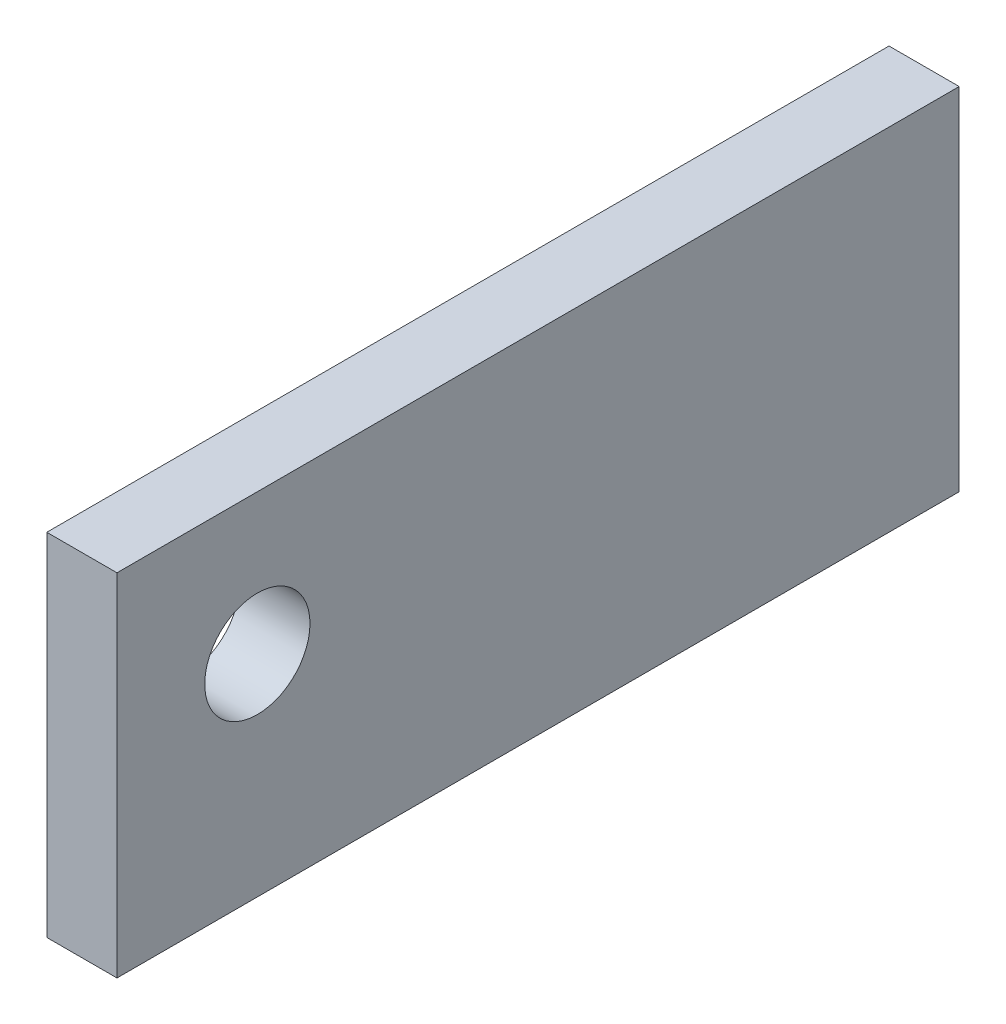
ISO-10303-21;
HEADER;
FILE_DESCRIPTION(('STEP AP214'),'2;1');
FILE_NAME('part.step','',(''),(''),'','','');
FILE_SCHEMA(('AUTOMOTIVE_DESIGN { 1 0 10303 214 1 1 1 1 }'));
ENDSEC;
DATA;
#1=APPLICATION_CONTEXT('core data for automotive mechanical design processes');
#2=APPLICATION_PROTOCOL_DEFINITION('international standard','automotive_design',2000,#1);
#3=PRODUCT_CONTEXT('',#1,'mechanical');
#4=PRODUCT('Part','Part','',(#3));
#5=PRODUCT_RELATED_PRODUCT_CATEGORY('part','',(#4));
#6=PRODUCT_DEFINITION_FORMATION('','',#4);
#7=PRODUCT_DEFINITION_CONTEXT('part definition',#1,'design');
#8=PRODUCT_DEFINITION('design','',#6,#7);
#9=PRODUCT_DEFINITION_SHAPE('','',#8);
#10=(LENGTH_UNIT() NAMED_UNIT(*) SI_UNIT(.MILLI.,.METRE.));
#11=(NAMED_UNIT(*) PLANE_ANGLE_UNIT() SI_UNIT($,.RADIAN.));
#12=(NAMED_UNIT(*) SI_UNIT($,.STERADIAN.) SOLID_ANGLE_UNIT());
#13=UNCERTAINTY_MEASURE_WITH_UNIT(LENGTH_MEASURE(1.E-05),#10,'distance_accuracy_value','');
#14=(GEOMETRIC_REPRESENTATION_CONTEXT(3) GLOBAL_UNCERTAINTY_ASSIGNED_CONTEXT((#13)) GLOBAL_UNIT_ASSIGNED_CONTEXT((#10,
#11,#12)) REPRESENTATION_CONTEXT('',''));
#15=CARTESIAN_POINT('',(0.,0.,0.));
#16=DIRECTION('',(0.,0.,1.));
#17=DIRECTION('',(1.,0.,0.));
#18=AXIS2_PLACEMENT_3D('',#15,#16,#17);
#19=CARTESIAN_POINT('',(6.35,31.75,-76.2));
#20=DIRECTION('',(0.,0.,1.));
#21=DIRECTION('',(1.,0.,0.));
#22=AXIS2_PLACEMENT_3D('',#19,#20,#21);
#23=PLANE('',#22);
#24=DIRECTION('',(0.,1.,0.));
#25=VECTOR('',#24,1.);
#26=CARTESIAN_POINT('',(-6.35,31.75,-76.2));
#27=LINE('',#26,#25);
#28=CARTESIAN_POINT('',(-6.35,-31.75,-76.2));
#29=VERTEX_POINT('',#28);
#30=CARTESIAN_POINT('',(-6.35,31.75,-76.2));
#31=VERTEX_POINT('',#30);
#32=EDGE_CURVE('E96',#29,#31,#27,.T.);
#33=ORIENTED_EDGE('',*,*,#32,.T.);
#34=DIRECTION('',(-1.,0.,0.));
#35=VECTOR('',#34,1.);
#36=CARTESIAN_POINT('',(6.35,31.75,-76.2));
#37=LINE('',#36,#35);
#38=CARTESIAN_POINT('',(6.35,31.75,-76.2));
#39=VERTEX_POINT('',#38);
#40=EDGE_CURVE('E11',#39,#31,#37,.T.);
#41=ORIENTED_EDGE('',*,*,#40,.F.);
#42=DIRECTION('',(0.,1.,0.));
#43=VECTOR('',#42,1.);
#44=CARTESIAN_POINT('',(6.35,31.75,-76.2));
#45=LINE('',#44,#43);
#46=CARTESIAN_POINT('',(6.35,-31.75,-76.2));
#47=VERTEX_POINT('',#46);
#48=EDGE_CURVE('E84',#47,#39,#45,.T.);
#49=ORIENTED_EDGE('',*,*,#48,.F.);
#50=DIRECTION('',(-1.,0.,0.));
#51=VECTOR('',#50,1.);
#52=CARTESIAN_POINT('',(6.35,-31.75,-76.2));
#53=LINE('',#52,#51);
#54=EDGE_CURVE('E92',#47,#29,#53,.T.);
#55=ORIENTED_EDGE('',*,*,#54,.T.);
#56=EDGE_LOOP('',(#33,#41,#49,#55));
#57=FACE_BOUND('',#56,.T.);
#58=ADVANCED_FACE('F33',(#57),#23,.F.);
#59=CARTESIAN_POINT('',(6.35,31.75,76.2));
#60=DIRECTION('',(0.,-1.,0.));
#61=DIRECTION('',(0.,0.,-1.));
#62=AXIS2_PLACEMENT_3D('',#59,#60,#61);
#63=PLANE('',#62);
#64=DIRECTION('',(0.,0.,1.));
#65=VECTOR('',#64,1.);
#66=CARTESIAN_POINT('',(-6.35,31.75,76.2));
#67=LINE('',#66,#65);
#68=CARTESIAN_POINT('',(-6.35,31.75,76.2));
#69=VERTEX_POINT('',#68);
#70=EDGE_CURVE('E88',#31,#69,#67,.T.);
#71=ORIENTED_EDGE('',*,*,#70,.T.);
#72=DIRECTION('',(-1.,0.,0.));
#73=VECTOR('',#72,1.);
#74=CARTESIAN_POINT('',(6.35,31.75,76.2));
#75=LINE('',#74,#73);
#76=CARTESIAN_POINT('',(6.35,31.75,76.2));
#77=VERTEX_POINT('',#76);
#78=EDGE_CURVE('E41',#77,#69,#75,.T.);
#79=ORIENTED_EDGE('',*,*,#78,.F.);
#80=DIRECTION('',(0.,0.,1.));
#81=VECTOR('',#80,1.);
#82=CARTESIAN_POINT('',(6.35,31.75,76.2));
#83=LINE('',#82,#81);
#84=EDGE_CURVE('E79',#39,#77,#83,.T.);
#85=ORIENTED_EDGE('',*,*,#84,.F.);
#86=ORIENTED_EDGE('',*,*,#40,.T.);
#87=EDGE_LOOP('',(#71,#79,#85,#86));
#88=FACE_BOUND('',#87,.T.);
#89=ADVANCED_FACE('F87',(#88),#63,.F.);
#90=CARTESIAN_POINT('',(6.35,31.75,76.2));
#91=DIRECTION('',(0.,0.,-1.));
#92=DIRECTION('',(0.,1.,0.));
#93=AXIS2_PLACEMENT_3D('',#90,#91,#92);
#94=PLANE('',#93);
#95=DIRECTION('',(0.,-1.,0.));
#96=VECTOR('',#95,1.);
#97=CARTESIAN_POINT('',(-6.35,31.75,76.2));
#98=LINE('',#97,#96);
#99=CARTESIAN_POINT('',(-6.35,-31.75,76.2));
#100=VERTEX_POINT('',#99);
#101=EDGE_CURVE('E66',#69,#100,#98,.T.);
#102=ORIENTED_EDGE('',*,*,#101,.T.);
#103=DIRECTION('',(-1.,0.,0.));
#104=VECTOR('',#103,1.);
#105=CARTESIAN_POINT('',(6.35,-31.75,76.2));
#106=LINE('',#105,#104);
#107=CARTESIAN_POINT('',(6.35,-31.75,76.2));
#108=VERTEX_POINT('',#107);
#109=EDGE_CURVE('E89',#108,#100,#106,.T.);
#110=ORIENTED_EDGE('',*,*,#109,.F.);
#111=DIRECTION('',(0.,-1.,0.));
#112=VECTOR('',#111,1.);
#113=CARTESIAN_POINT('',(6.35,31.75,76.2));
#114=LINE('',#113,#112);
#115=EDGE_CURVE('E82',#77,#108,#114,.T.);
#116=ORIENTED_EDGE('',*,*,#115,.F.);
#117=ORIENTED_EDGE('',*,*,#78,.T.);
#118=EDGE_LOOP('',(#102,#110,#116,#117));
#119=FACE_BOUND('',#118,.T.);
#120=ADVANCED_FACE('F90',(#119),#94,.F.);
#121=CARTESIAN_POINT('',(6.35,-31.75,76.2));
#122=DIRECTION('',(0.,1.,0.));
#123=DIRECTION('',(0.,0.,1.));
#124=AXIS2_PLACEMENT_3D('',#121,#122,#123);
#125=PLANE('',#124);
#126=DIRECTION('',(0.,0.,-1.));
#127=VECTOR('',#126,1.);
#128=CARTESIAN_POINT('',(-6.35,-31.75,76.2));
#129=LINE('',#128,#127);
#130=EDGE_CURVE('E72',#100,#29,#129,.T.);
#131=ORIENTED_EDGE('',*,*,#130,.T.);
#132=ORIENTED_EDGE('',*,*,#54,.F.);
#133=DIRECTION('',(0.,0.,-1.));
#134=VECTOR('',#133,1.);
#135=CARTESIAN_POINT('',(6.35,-31.75,76.2));
#136=LINE('',#135,#134);
#137=EDGE_CURVE('E49',#108,#47,#136,.T.);
#138=ORIENTED_EDGE('',*,*,#137,.F.);
#139=ORIENTED_EDGE('',*,*,#109,.T.);
#140=EDGE_LOOP('',(#131,#132,#138,#139));
#141=FACE_BOUND('',#140,.T.);
#142=ADVANCED_FACE('F104',(#141),#125,.F.);
#143=CARTESIAN_POINT('',(6.35,0.,0.));
#144=DIRECTION('',(1.,0.,0.));
#145=DIRECTION('',(0.,0.,-1.));
#146=AXIS2_PLACEMENT_3D('',#143,#144,#145);
#147=PLANE('',#146);
#148=CARTESIAN_POINT('',(6.35,6.35000000000001,50.8));
#149=DIRECTION('',(1.,0.,0.));
#150=DIRECTION('',(0.,0.,-1.));
#151=AXIS2_PLACEMENT_3D('',#148,#149,#150);
#152=CIRCLE('',#151,9.52500000000001);
#153=CARTESIAN_POINT('',(6.35,6.35000000000001,41.275));
#154=VERTEX_POINT('',#153);
#155=EDGE_CURVE('E112',#154,#154,#152,.T.);
#156=ORIENTED_EDGE('',*,*,#155,.F.);
#157=EDGE_LOOP('',(#156));
#158=FACE_BOUND('',#157,.T.);
#159=ORIENTED_EDGE('',*,*,#48,.T.);
#160=ORIENTED_EDGE('',*,*,#84,.T.);
#161=ORIENTED_EDGE('',*,*,#115,.T.);
#162=ORIENTED_EDGE('',*,*,#137,.T.);
#163=EDGE_LOOP('',(#159,#160,#161,#162));
#164=FACE_BOUND('',#163,.T.);
#165=ADVANCED_FACE('F80',(#158,#164),#147,.T.);
#166=CARTESIAN_POINT('',(-6.35,0.,0.));
#167=DIRECTION('',(1.,0.,0.));
#168=DIRECTION('',(0.,0.,-1.));
#169=AXIS2_PLACEMENT_3D('',#166,#167,#168);
#170=PLANE('',#169);
#171=CARTESIAN_POINT('',(-6.35,6.35000000000001,50.8));
#172=DIRECTION('',(1.,0.,0.));
#173=DIRECTION('',(0.,0.,-1.));
#174=AXIS2_PLACEMENT_3D('',#171,#172,#173);
#175=CIRCLE('',#174,9.52500000000001);
#176=CARTESIAN_POINT('',(-6.35,6.35000000000001,41.275));
#177=VERTEX_POINT('',#176);
#178=EDGE_CURVE('E99',#177,#177,#175,.F.);
#179=ORIENTED_EDGE('',*,*,#178,.F.);
#180=EDGE_LOOP('',(#179));
#181=FACE_BOUND('',#180,.T.);
#182=ORIENTED_EDGE('',*,*,#32,.F.);
#183=ORIENTED_EDGE('',*,*,#130,.F.);
#184=ORIENTED_EDGE('',*,*,#101,.F.);
#185=ORIENTED_EDGE('',*,*,#70,.F.);
#186=EDGE_LOOP('',(#182,#183,#184,#185));
#187=FACE_BOUND('',#186,.T.);
#188=ADVANCED_FACE('F107',(#181,#187),#170,.F.);
#189=CARTESIAN_POINT('',(-6.351,6.35000000000001,50.8));
#190=DIRECTION('',(1.,0.,0.));
#191=DIRECTION('',(0.,0.,-1.));
#192=AXIS2_PLACEMENT_3D('',#189,#190,#191);
#193=CYLINDRICAL_SURFACE('',#192,9.52500000000001);
#194=ORIENTED_EDGE('',*,*,#155,.T.);
#195=EDGE_LOOP('',(#194));
#196=FACE_BOUND('',#195,.T.);
#197=ORIENTED_EDGE('',*,*,#178,.T.);
#198=EDGE_LOOP('',(#197));
#199=FACE_BOUND('',#198,.T.);
#200=ADVANCED_FACE('F116',(#196,#199),#193,.F.);
#201=CLOSED_SHELL('',(#58,#89,#120,#142,#165,#188,#200));
#202=MANIFOLD_SOLID_BREP('B2',#201);
#203=ADVANCED_BREP_SHAPE_REPRESENTATION('',(#18,#202),#14);
#204=SHAPE_DEFINITION_REPRESENTATION(#9,#203);
ENDSEC;
END-ISO-10303-21;
